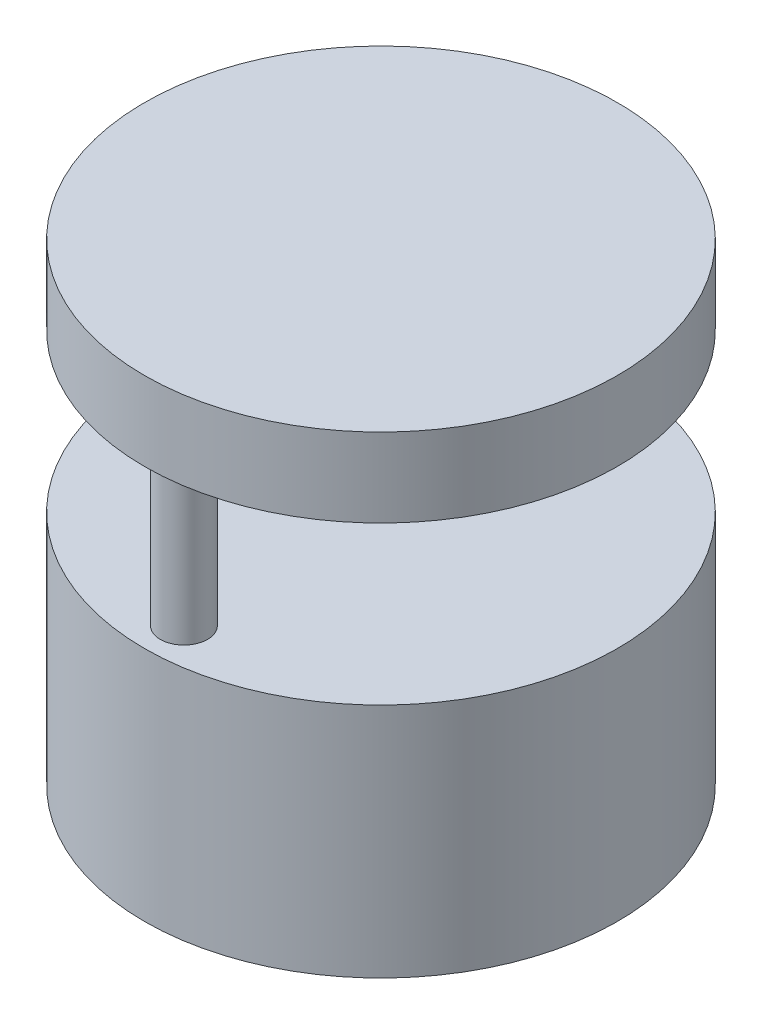
ISO-10303-21;
HEADER;
FILE_DESCRIPTION(('STEP AP214'),'2;1');
FILE_NAME('part.step','',(''),(''),'','','');
FILE_SCHEMA(('AUTOMOTIVE_DESIGN { 1 0 10303 214 1 1 1 1 }'));
ENDSEC;
DATA;
#1=APPLICATION_CONTEXT('core data for automotive mechanical design processes');
#2=APPLICATION_PROTOCOL_DEFINITION('international standard','automotive_design',2000,#1);
#3=PRODUCT_CONTEXT('',#1,'mechanical');
#4=PRODUCT('Part','Part','',(#3));
#5=PRODUCT_RELATED_PRODUCT_CATEGORY('part','',(#4));
#6=PRODUCT_DEFINITION_FORMATION('','',#4);
#7=PRODUCT_DEFINITION_CONTEXT('part definition',#1,'design');
#8=PRODUCT_DEFINITION('design','',#6,#7);
#9=PRODUCT_DEFINITION_SHAPE('','',#8);
#10=(LENGTH_UNIT() NAMED_UNIT(*) SI_UNIT(.MILLI.,.METRE.));
#11=(NAMED_UNIT(*) PLANE_ANGLE_UNIT() SI_UNIT($,.RADIAN.));
#12=(NAMED_UNIT(*) SI_UNIT($,.STERADIAN.) SOLID_ANGLE_UNIT());
#13=UNCERTAINTY_MEASURE_WITH_UNIT(LENGTH_MEASURE(1.E-05),#10,'distance_accuracy_value','');
#14=(GEOMETRIC_REPRESENTATION_CONTEXT(3) GLOBAL_UNCERTAINTY_ASSIGNED_CONTEXT((#13)) GLOBAL_UNIT_ASSIGNED_CONTEXT((#10,
#11,#12)) REPRESENTATION_CONTEXT('',''));
#15=CARTESIAN_POINT('',(0.,0.,0.));
#16=DIRECTION('',(0.,0.,1.));
#17=DIRECTION('',(1.,0.,0.));
#18=AXIS2_PLACEMENT_3D('',#15,#16,#17);
#19=CARTESIAN_POINT('',(0.,300.,0.));
#20=DIRECTION('',(0.,-1.,0.));
#21=DIRECTION('',(0.,0.,-1.));
#22=AXIS2_PLACEMENT_3D('',#19,#20,#21);
#23=CYLINDRICAL_SURFACE('',#22,300.);
#24=CARTESIAN_POINT('',(0.,300.,0.));
#25=DIRECTION('',(0.,1.,0.));
#26=DIRECTION('',(0.,0.,1.));
#27=AXIS2_PLACEMENT_3D('',#24,#25,#26);
#28=CIRCLE('',#27,300.);
#29=CARTESIAN_POINT('',(0.,300.,300.));
#30=VERTEX_POINT('',#29);
#31=EDGE_CURVE('E10',#30,#30,#28,.T.);
#32=ORIENTED_EDGE('',*,*,#31,.F.);
#33=EDGE_LOOP('',(#32));
#34=FACE_BOUND('',#33,.T.);
#35=CARTESIAN_POINT('',(0.,0.,0.));
#36=DIRECTION('',(0.,1.,0.));
#37=DIRECTION('',(0.,0.,1.));
#38=AXIS2_PLACEMENT_3D('',#35,#36,#37);
#39=CIRCLE('',#38,300.);
#40=CARTESIAN_POINT('',(0.,0.,300.));
#41=VERTEX_POINT('',#40);
#42=EDGE_CURVE('E33',#41,#41,#39,.T.);
#43=ORIENTED_EDGE('',*,*,#42,.T.);
#44=EDGE_LOOP('',(#43));
#45=FACE_BOUND('',#44,.T.);
#46=ADVANCED_FACE('F30',(#34,#45),#23,.T.);
#47=CARTESIAN_POINT('',(0.,300.,0.));
#48=DIRECTION('',(0.,1.,0.));
#49=DIRECTION('',(0.,0.,1.));
#50=AXIS2_PLACEMENT_3D('',#47,#48,#49);
#51=PLANE('',#50);
#52=CARTESIAN_POINT('',(0.,300.,250.));
#53=DIRECTION('',(0.,1.,0.));
#54=DIRECTION('',(0.,0.,1.));
#55=AXIS2_PLACEMENT_3D('',#52,#53,#54);
#56=CIRCLE('',#55,30.);
#57=CARTESIAN_POINT('',(0.,300.,280.));
#58=VERTEX_POINT('',#57);
#59=EDGE_CURVE('E48',#58,#58,#56,.T.);
#60=ORIENTED_EDGE('',*,*,#59,.F.);
#61=EDGE_LOOP('',(#60));
#62=FACE_BOUND('',#61,.T.);
#63=CARTESIAN_POINT('',(0.,300.,-250.));
#64=DIRECTION('',(0.,1.,0.));
#65=DIRECTION('',(0.,0.,1.));
#66=AXIS2_PLACEMENT_3D('',#63,#64,#65);
#67=CIRCLE('',#66,30.);
#68=CARTESIAN_POINT('',(0.,300.,-220.));
#69=VERTEX_POINT('',#68);
#70=EDGE_CURVE('E42',#69,#69,#67,.T.);
#71=ORIENTED_EDGE('',*,*,#70,.F.);
#72=EDGE_LOOP('',(#71));
#73=FACE_BOUND('',#72,.T.);
#74=ORIENTED_EDGE('',*,*,#31,.T.);
#75=EDGE_LOOP('',(#74));
#76=FACE_BOUND('',#75,.T.);
#77=ADVANCED_FACE('F79',(#62,#73,#76),#51,.T.);
#78=CARTESIAN_POINT('',(0.,0.,0.));
#79=DIRECTION('',(0.,1.,0.));
#80=DIRECTION('',(0.,0.,1.));
#81=AXIS2_PLACEMENT_3D('',#78,#79,#80);
#82=PLANE('',#81);
#83=ORIENTED_EDGE('',*,*,#42,.F.);
#84=EDGE_LOOP('',(#83));
#85=FACE_BOUND('',#84,.T.);
#86=ADVANCED_FACE('F84',(#85),#82,.F.);
#87=CARTESIAN_POINT('',(0.,500.,-250.));
#88=DIRECTION('',(0.,-1.,0.));
#89=DIRECTION('',(0.,0.,-1.));
#90=AXIS2_PLACEMENT_3D('',#87,#88,#89);
#91=CYLINDRICAL_SURFACE('',#90,30.);
#92=CARTESIAN_POINT('',(0.,500.,-250.));
#93=DIRECTION('',(0.,1.,0.));
#94=DIRECTION('',(0.,0.,1.));
#95=AXIS2_PLACEMENT_3D('',#92,#93,#94);
#96=CIRCLE('',#95,30.);
#97=CARTESIAN_POINT('',(0.,500.,-220.));
#98=VERTEX_POINT('',#97);
#99=EDGE_CURVE('E40',#98,#98,#96,.T.);
#100=ORIENTED_EDGE('',*,*,#99,.F.);
#101=EDGE_LOOP('',(#100));
#102=FACE_BOUND('',#101,.T.);
#103=ORIENTED_EDGE('',*,*,#70,.T.);
#104=EDGE_LOOP('',(#103));
#105=FACE_BOUND('',#104,.T.);
#106=ADVANCED_FACE('F91',(#102,#105),#91,.T.);
#107=CARTESIAN_POINT('',(0.,500.,250.));
#108=DIRECTION('',(0.,-1.,0.));
#109=DIRECTION('',(0.,0.,-1.));
#110=AXIS2_PLACEMENT_3D('',#107,#108,#109);
#111=CYLINDRICAL_SURFACE('',#110,30.);
#112=CARTESIAN_POINT('',(0.,500.,250.));
#113=DIRECTION('',(0.,1.,0.));
#114=DIRECTION('',(0.,0.,1.));
#115=AXIS2_PLACEMENT_3D('',#112,#113,#114);
#116=CIRCLE('',#115,30.);
#117=CARTESIAN_POINT('',(0.,500.,280.));
#118=VERTEX_POINT('',#117);
#119=EDGE_CURVE('E45',#118,#118,#116,.T.);
#120=ORIENTED_EDGE('',*,*,#119,.F.);
#121=EDGE_LOOP('',(#120));
#122=FACE_BOUND('',#121,.T.);
#123=ORIENTED_EDGE('',*,*,#59,.T.);
#124=EDGE_LOOP('',(#123));
#125=FACE_BOUND('',#124,.T.);
#126=ADVANCED_FACE('F65',(#122,#125),#111,.T.);
#127=CARTESIAN_POINT('',(0.,600.,0.));
#128=DIRECTION('',(0.,-1.,0.));
#129=DIRECTION('',(0.,0.,-1.));
#130=AXIS2_PLACEMENT_3D('',#127,#128,#129);
#131=CYLINDRICAL_SURFACE('',#130,300.);
#132=CARTESIAN_POINT('',(0.,600.,0.));
#133=DIRECTION('',(0.,1.,0.));
#134=DIRECTION('',(0.,0.,1.));
#135=AXIS2_PLACEMENT_3D('',#132,#133,#134);
#136=CIRCLE('',#135,300.);
#137=CARTESIAN_POINT('',(0.,600.,300.));
#138=VERTEX_POINT('',#137);
#139=EDGE_CURVE('E51',#138,#138,#136,.T.);
#140=ORIENTED_EDGE('',*,*,#139,.F.);
#141=EDGE_LOOP('',(#140));
#142=FACE_BOUND('',#141,.T.);
#143=CARTESIAN_POINT('',(0.,500.,0.));
#144=DIRECTION('',(0.,1.,0.));
#145=DIRECTION('',(0.,0.,1.));
#146=AXIS2_PLACEMENT_3D('',#143,#144,#145);
#147=CIRCLE('',#146,300.);
#148=CARTESIAN_POINT('',(0.,500.,300.));
#149=VERTEX_POINT('',#148);
#150=EDGE_CURVE('E54',#149,#149,#147,.T.);
#151=ORIENTED_EDGE('',*,*,#150,.T.);
#152=EDGE_LOOP('',(#151));
#153=FACE_BOUND('',#152,.T.);
#154=ADVANCED_FACE('F62',(#142,#153),#131,.T.);
#155=CARTESIAN_POINT('',(0.,600.,0.));
#156=DIRECTION('',(0.,1.,0.));
#157=DIRECTION('',(0.,0.,1.));
#158=AXIS2_PLACEMENT_3D('',#155,#156,#157);
#159=PLANE('',#158);
#160=ORIENTED_EDGE('',*,*,#139,.T.);
#161=EDGE_LOOP('',(#160));
#162=FACE_BOUND('',#161,.T.);
#163=ADVANCED_FACE('F60',(#162),#159,.T.);
#164=CARTESIAN_POINT('',(0.,500.,0.));
#165=DIRECTION('',(0.,1.,0.));
#166=DIRECTION('',(0.,0.,1.));
#167=AXIS2_PLACEMENT_3D('',#164,#165,#166);
#168=PLANE('',#167);
#169=ORIENTED_EDGE('',*,*,#99,.T.);
#170=EDGE_LOOP('',(#169));
#171=FACE_BOUND('',#170,.T.);
#172=ORIENTED_EDGE('',*,*,#119,.T.);
#173=EDGE_LOOP('',(#172));
#174=FACE_BOUND('',#173,.T.);
#175=ORIENTED_EDGE('',*,*,#150,.F.);
#176=EDGE_LOOP('',(#175));
#177=FACE_BOUND('',#176,.T.);
#178=ADVANCED_FACE('F69',(#171,#174,#177),#168,.F.);
#179=CLOSED_SHELL('',(#46,#77,#86,#106,#126,#154,#163,#178));
#180=MANIFOLD_SOLID_BREP('B2',#179);
#181=ADVANCED_BREP_SHAPE_REPRESENTATION('',(#18,#180),#14);
#182=SHAPE_DEFINITION_REPRESENTATION(#9,#181);
ENDSEC;
END-ISO-10303-21;
